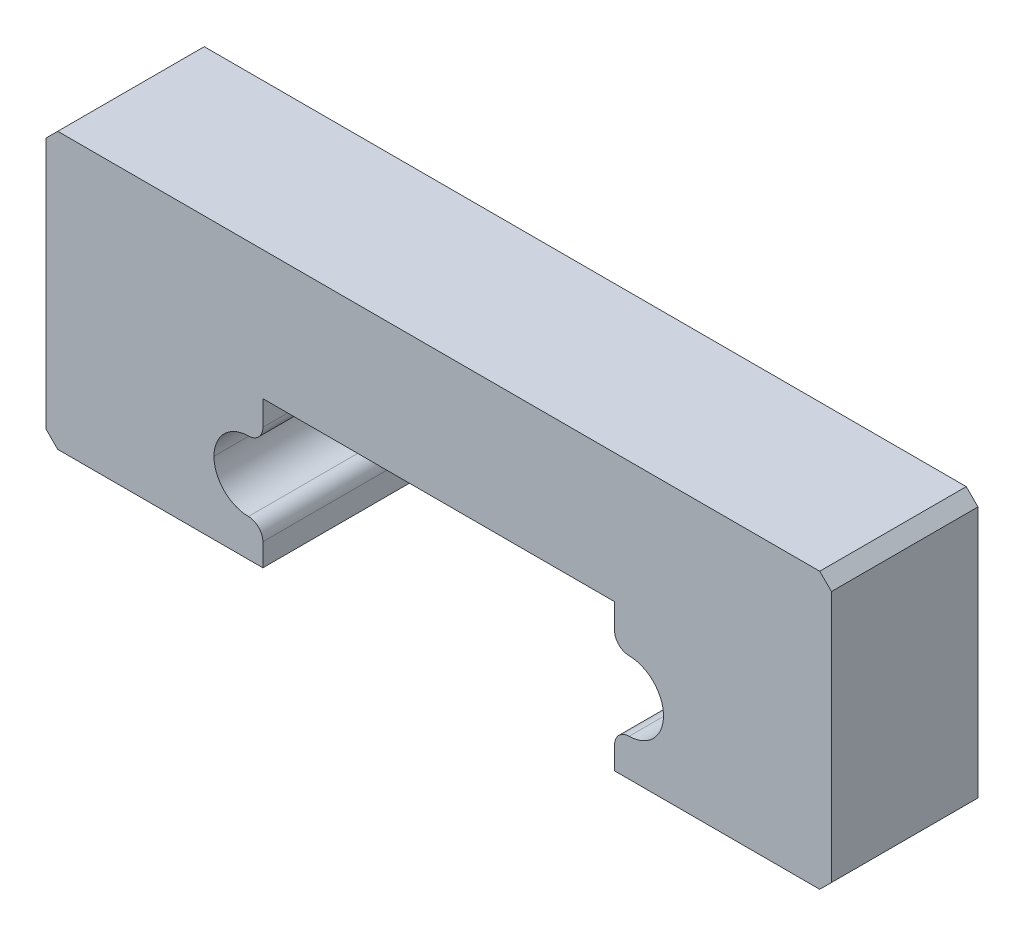
ISO-10303-21;
HEADER;
FILE_DESCRIPTION(('STEP AP214'),'2;1');
FILE_NAME('part.step','',(''),(''),'','','');
FILE_SCHEMA(('AUTOMOTIVE_DESIGN { 1 0 10303 214 1 1 1 1 }'));
ENDSEC;
DATA;
#1=APPLICATION_CONTEXT('core data for automotive mechanical design processes');
#2=APPLICATION_PROTOCOL_DEFINITION('international standard','automotive_design',2000,#1);
#3=PRODUCT_CONTEXT('',#1,'mechanical');
#4=PRODUCT('Part','Part','',(#3));
#5=PRODUCT_RELATED_PRODUCT_CATEGORY('part','',(#4));
#6=PRODUCT_DEFINITION_FORMATION('','',#4);
#7=PRODUCT_DEFINITION_CONTEXT('part definition',#1,'design');
#8=PRODUCT_DEFINITION('design','',#6,#7);
#9=PRODUCT_DEFINITION_SHAPE('','',#8);
#10=(LENGTH_UNIT() NAMED_UNIT(*) SI_UNIT(.MILLI.,.METRE.));
#11=(NAMED_UNIT(*) PLANE_ANGLE_UNIT() SI_UNIT($,.RADIAN.));
#12=(NAMED_UNIT(*) SI_UNIT($,.STERADIAN.) SOLID_ANGLE_UNIT());
#13=UNCERTAINTY_MEASURE_WITH_UNIT(LENGTH_MEASURE(1.E-05),#10,'distance_accuracy_value','');
#14=(GEOMETRIC_REPRESENTATION_CONTEXT(3) GLOBAL_UNCERTAINTY_ASSIGNED_CONTEXT((#13)) GLOBAL_UNIT_ASSIGNED_CONTEXT((#10,
#11,#12)) REPRESENTATION_CONTEXT('',''));
#15=CARTESIAN_POINT('',(0.,0.,0.));
#16=DIRECTION('',(0.,0.,1.));
#17=DIRECTION('',(1.,0.,0.));
#18=AXIS2_PLACEMENT_3D('',#15,#16,#17);
#19=CARTESIAN_POINT('',(-6.5,-4.22988165266092,5.));
#20=DIRECTION('',(0.,0.,-1.));
#21=DIRECTION('',(-1.,0.,0.));
#22=AXIS2_PLACEMENT_3D('',#19,#20,#21);
#23=CYLINDRICAL_SURFACE('',#22,0.5);
#24=CARTESIAN_POINT('',(-6.5,-4.22988165266092,5.));
#25=DIRECTION('',(0.,0.,1.));
#26=DIRECTION('',(1.,0.,0.));
#27=AXIS2_PLACEMENT_3D('',#24,#25,#26);
#28=CIRCLE('',#27,0.5);
#29=CARTESIAN_POINT('',(-6.,-4.22988165266092,5.));
#30=VERTEX_POINT('',#29);
#31=CARTESIAN_POINT('',(-6.49408284023669,-3.72991666666656,5.));
#32=VERTEX_POINT('',#31);
#33=EDGE_CURVE('E246',#30,#32,#28,.T.);
#34=ORIENTED_EDGE('',*,*,#33,.F.);
#35=DIRECTION('',(0.,0.,1.));
#36=VECTOR('',#35,1.);
#37=CARTESIAN_POINT('',(-6.,-4.22988165266092,5.));
#38=LINE('',#37,#36);
#39=CARTESIAN_POINT('',(-6.,-4.22988165266092,0.));
#40=VERTEX_POINT('',#39);
#41=EDGE_CURVE('E273',#40,#30,#38,.T.);
#42=ORIENTED_EDGE('',*,*,#41,.F.);
#43=CARTESIAN_POINT('',(-6.5,-4.22988165266092,0.));
#44=DIRECTION('',(0.,0.,-1.));
#45=DIRECTION('',(1.,0.,0.));
#46=AXIS2_PLACEMENT_3D('',#43,#44,#45);
#47=CIRCLE('',#46,0.5);
#48=CARTESIAN_POINT('',(-6.49408284023669,-3.72991666666656,0.));
#49=VERTEX_POINT('',#48);
#50=EDGE_CURVE('E11',#49,#40,#47,.T.);
#51=ORIENTED_EDGE('',*,*,#50,.F.);
#52=DIRECTION('',(0.,0.,-1.));
#53=VECTOR('',#52,1.);
#54=CARTESIAN_POINT('',(-6.49408284023669,-3.72991666666656,5.));
#55=LINE('',#54,#53);
#56=EDGE_CURVE('E322',#32,#49,#55,.T.);
#57=ORIENTED_EDGE('',*,*,#56,.F.);
#58=EDGE_LOOP('',(#34,#42,#51,#57));
#59=FACE_BOUND('',#58,.T.);
#60=ADVANCED_FACE('F16',(#59),#23,.T.);
#61=CARTESIAN_POINT('',(-6.5,-0.850118347339081,5.));
#62=DIRECTION('',(0.,0.,-1.));
#63=DIRECTION('',(-1.,0.,0.));
#64=AXIS2_PLACEMENT_3D('',#61,#62,#63);
#65=CYLINDRICAL_SURFACE('',#64,0.5);
#66=CARTESIAN_POINT('',(-6.5,-0.850118347339081,5.));
#67=DIRECTION('',(0.,0.,1.));
#68=DIRECTION('',(1.,0.,0.));
#69=AXIS2_PLACEMENT_3D('',#66,#67,#68);
#70=CIRCLE('',#69,0.5);
#71=CARTESIAN_POINT('',(-6.49408284023669,-1.35008333333344,5.));
#72=VERTEX_POINT('',#71);
#73=CARTESIAN_POINT('',(-6.,-0.850118347339081,5.));
#74=VERTEX_POINT('',#73);
#75=EDGE_CURVE('E205',#72,#74,#70,.T.);
#76=ORIENTED_EDGE('',*,*,#75,.F.);
#77=DIRECTION('',(0.,0.,1.));
#78=VECTOR('',#77,1.);
#79=CARTESIAN_POINT('',(-6.49408284023669,-1.35008333333344,5.));
#80=LINE('',#79,#78);
#81=CARTESIAN_POINT('',(-6.49408284023669,-1.35008333333344,0.));
#82=VERTEX_POINT('',#81);
#83=EDGE_CURVE('E203',#82,#72,#80,.T.);
#84=ORIENTED_EDGE('',*,*,#83,.F.);
#85=CARTESIAN_POINT('',(-6.5,-0.850118347339081,0.));
#86=DIRECTION('',(0.,0.,-1.));
#87=DIRECTION('',(1.,0.,0.));
#88=AXIS2_PLACEMENT_3D('',#85,#86,#87);
#89=CIRCLE('',#88,0.5);
#90=CARTESIAN_POINT('',(-6.,-0.850118347339081,0.));
#91=VERTEX_POINT('',#90);
#92=EDGE_CURVE('E27',#91,#82,#89,.T.);
#93=ORIENTED_EDGE('',*,*,#92,.F.);
#94=DIRECTION('',(0.,0.,-1.));
#95=VECTOR('',#94,1.);
#96=CARTESIAN_POINT('',(-6.,-0.850118347339081,5.));
#97=LINE('',#96,#95);
#98=EDGE_CURVE('E236',#74,#91,#97,.T.);
#99=ORIENTED_EDGE('',*,*,#98,.F.);
#100=EDGE_LOOP('',(#76,#84,#93,#99));
#101=FACE_BOUND('',#100,.T.);
#102=ADVANCED_FACE('F204',(#101),#65,.T.);
#103=CARTESIAN_POINT('',(6.5,-0.850118347339077,5.));
#104=DIRECTION('',(0.,0.,-1.));
#105=DIRECTION('',(-1.,0.,0.));
#106=AXIS2_PLACEMENT_3D('',#103,#104,#105);
#107=CYLINDRICAL_SURFACE('',#106,0.5);
#108=CARTESIAN_POINT('',(6.5,-0.850118347339077,5.));
#109=DIRECTION('',(0.,0.,1.));
#110=DIRECTION('',(1.,0.,0.));
#111=AXIS2_PLACEMENT_3D('',#108,#109,#110);
#112=CIRCLE('',#111,0.5);
#113=CARTESIAN_POINT('',(6.,-0.850118347339077,5.));
#114=VERTEX_POINT('',#113);
#115=CARTESIAN_POINT('',(6.49408284023669,-1.35008333333343,5.));
#116=VERTEX_POINT('',#115);
#117=EDGE_CURVE('E280',#114,#116,#112,.T.);
#118=ORIENTED_EDGE('',*,*,#117,.F.);
#119=DIRECTION('',(0.,0.,1.));
#120=VECTOR('',#119,1.);
#121=CARTESIAN_POINT('',(6.,-0.850118347339077,5.));
#122=LINE('',#121,#120);
#123=CARTESIAN_POINT('',(6.,-0.850118347339077,0.));
#124=VERTEX_POINT('',#123);
#125=EDGE_CURVE('E265',#124,#114,#122,.T.);
#126=ORIENTED_EDGE('',*,*,#125,.F.);
#127=CARTESIAN_POINT('',(6.5,-0.850118347339077,0.));
#128=DIRECTION('',(0.,0.,-1.));
#129=DIRECTION('',(1.,0.,0.));
#130=AXIS2_PLACEMENT_3D('',#127,#128,#129);
#131=CIRCLE('',#130,0.5);
#132=CARTESIAN_POINT('',(6.49408284023669,-1.35008333333343,0.));
#133=VERTEX_POINT('',#132);
#134=EDGE_CURVE('E200',#133,#124,#131,.T.);
#135=ORIENTED_EDGE('',*,*,#134,.F.);
#136=DIRECTION('',(0.,0.,-1.));
#137=VECTOR('',#136,1.);
#138=CARTESIAN_POINT('',(6.49408284023669,-1.35008333333343,5.));
#139=LINE('',#138,#137);
#140=EDGE_CURVE('E231',#116,#133,#139,.T.);
#141=ORIENTED_EDGE('',*,*,#140,.F.);
#142=EDGE_LOOP('',(#118,#126,#135,#141));
#143=FACE_BOUND('',#142,.T.);
#144=ADVANCED_FACE('F414',(#143),#107,.T.);
#145=CARTESIAN_POINT('',(6.5,-4.22988165266092,5.));
#146=DIRECTION('',(0.,0.,-1.));
#147=DIRECTION('',(-1.,0.,0.));
#148=AXIS2_PLACEMENT_3D('',#145,#146,#147);
#149=CYLINDRICAL_SURFACE('',#148,0.5);
#150=CARTESIAN_POINT('',(6.5,-4.22988165266092,5.));
#151=DIRECTION('',(0.,0.,1.));
#152=DIRECTION('',(1.,0.,0.));
#153=AXIS2_PLACEMENT_3D('',#150,#151,#152);
#154=CIRCLE('',#153,0.5);
#155=CARTESIAN_POINT('',(6.49408284023669,-3.72991666666656,5.));
#156=VERTEX_POINT('',#155);
#157=CARTESIAN_POINT('',(6.,-4.22988165266092,5.));
#158=VERTEX_POINT('',#157);
#159=EDGE_CURVE('E249',#156,#158,#154,.T.);
#160=ORIENTED_EDGE('',*,*,#159,.F.);
#161=DIRECTION('',(0.,0.,1.));
#162=VECTOR('',#161,1.);
#163=CARTESIAN_POINT('',(6.49408284023669,-3.72991666666656,5.));
#164=LINE('',#163,#162);
#165=CARTESIAN_POINT('',(6.49408284023669,-3.72991666666656,0.));
#166=VERTEX_POINT('',#165);
#167=EDGE_CURVE('E269',#166,#156,#164,.T.);
#168=ORIENTED_EDGE('',*,*,#167,.F.);
#169=CARTESIAN_POINT('',(6.5,-4.22988165266092,0.));
#170=DIRECTION('',(0.,0.,-1.));
#171=DIRECTION('',(1.,0.,0.));
#172=AXIS2_PLACEMENT_3D('',#169,#170,#171);
#173=CIRCLE('',#172,0.5);
#174=CARTESIAN_POINT('',(6.,-4.22988165266092,0.));
#175=VERTEX_POINT('',#174);
#176=EDGE_CURVE('E283',#175,#166,#173,.T.);
#177=ORIENTED_EDGE('',*,*,#176,.F.);
#178=DIRECTION('',(0.,0.,-1.));
#179=VECTOR('',#178,1.);
#180=CARTESIAN_POINT('',(6.,-4.22988165266092,5.));
#181=LINE('',#180,#179);
#182=EDGE_CURVE('E230',#158,#175,#181,.T.);
#183=ORIENTED_EDGE('',*,*,#182,.F.);
#184=EDGE_LOOP('',(#160,#168,#177,#183));
#185=FACE_BOUND('',#184,.T.);
#186=ADVANCED_FACE('F408',(#185),#149,.T.);
#187=CARTESIAN_POINT('',(-6.48,-2.54,0.));
#188=DIRECTION('',(0.,0.,1.));
#189=DIRECTION('',(1.,0.,0.));
#190=AXIS2_PLACEMENT_3D('',#187,#188,#189);
#191=PLANE('',#190);
#192=DIRECTION('',(0.,-1.,0.));
#193=VECTOR('',#192,1.);
#194=CARTESIAN_POINT('',(6.,-5.,0.));
#195=LINE('',#194,#193);
#196=CARTESIAN_POINT('',(6.,-5.,0.));
#197=VERTEX_POINT('',#196);
#198=EDGE_CURVE('E241',#175,#197,#195,.T.);
#199=ORIENTED_EDGE('',*,*,#198,.F.);
#200=ORIENTED_EDGE('',*,*,#176,.T.);
#201=CARTESIAN_POINT('',(6.48,-2.54,0.));
#202=DIRECTION('',(0.,0.,-1.));
#203=DIRECTION('',(-1.,0.,0.));
#204=AXIS2_PLACEMENT_3D('',#201,#202,#203);
#205=CIRCLE('',#204,1.19);
#206=EDGE_CURVE('E264',#133,#166,#205,.T.);
#207=ORIENTED_EDGE('',*,*,#206,.F.);
#208=ORIENTED_EDGE('',*,*,#134,.T.);
#209=DIRECTION('',(0.,-1.,0.));
#210=VECTOR('',#209,1.);
#211=CARTESIAN_POINT('',(6.,0.,0.));
#212=LINE('',#211,#210);
#213=CARTESIAN_POINT('',(6.,0.,0.));
#214=VERTEX_POINT('',#213);
#215=EDGE_CURVE('E379',#214,#124,#212,.T.);
#216=ORIENTED_EDGE('',*,*,#215,.F.);
#217=DIRECTION('',(1.,0.,0.));
#218=VECTOR('',#217,1.);
#219=CARTESIAN_POINT('',(6.,0.,0.));
#220=LINE('',#219,#218);
#221=CARTESIAN_POINT('',(-6.,0.,0.));
#222=VERTEX_POINT('',#221);
#223=EDGE_CURVE('E316',#222,#214,#220,.T.);
#224=ORIENTED_EDGE('',*,*,#223,.F.);
#225=DIRECTION('',(0.,1.,0.));
#226=VECTOR('',#225,1.);
#227=CARTESIAN_POINT('',(-6.,0.,0.));
#228=LINE('',#227,#226);
#229=EDGE_CURVE('E195',#91,#222,#228,.T.);
#230=ORIENTED_EDGE('',*,*,#229,.F.);
#231=ORIENTED_EDGE('',*,*,#92,.T.);
#232=CARTESIAN_POINT('',(-6.48,-2.54,0.));
#233=DIRECTION('',(0.,0.,-1.));
#234=DIRECTION('',(1.,0.,0.));
#235=AXIS2_PLACEMENT_3D('',#232,#233,#234);
#236=CIRCLE('',#235,1.19);
#237=CARTESIAN_POINT('',(-7.67,-2.54,0.));
#238=VERTEX_POINT('',#237);
#239=EDGE_CURVE('E192',#238,#82,#236,.T.);
#240=ORIENTED_EDGE('',*,*,#239,.F.);
#241=CARTESIAN_POINT('',(-6.48,-2.54,0.));
#242=DIRECTION('',(0.,0.,-1.));
#243=DIRECTION('',(1.,0.,0.));
#244=AXIS2_PLACEMENT_3D('',#241,#242,#243);
#245=CIRCLE('',#244,1.19);
#246=EDGE_CURVE('E237',#49,#238,#245,.T.);
#247=ORIENTED_EDGE('',*,*,#246,.F.);
#248=ORIENTED_EDGE('',*,*,#50,.T.);
#249=DIRECTION('',(0.,1.,0.));
#250=VECTOR('',#249,1.);
#251=CARTESIAN_POINT('',(-6.,-5.,0.));
#252=LINE('',#251,#250);
#253=CARTESIAN_POINT('',(-6.,-5.,0.));
#254=VERTEX_POINT('',#253);
#255=EDGE_CURVE('E210',#254,#40,#252,.T.);
#256=ORIENTED_EDGE('',*,*,#255,.F.);
#257=DIRECTION('',(1.,0.,0.));
#258=VECTOR('',#257,1.);
#259=CARTESIAN_POINT('',(-6.,-5.,0.));
#260=LINE('',#259,#258);
#261=CARTESIAN_POINT('',(-13.,-5.,0.));
#262=VERTEX_POINT('',#261);
#263=EDGE_CURVE('E425',#262,#254,#260,.T.);
#264=ORIENTED_EDGE('',*,*,#263,.F.);
#265=DIRECTION('',(0.707106781186548,-0.707106781186548,0.));
#266=VECTOR('',#265,1.);
#267=CARTESIAN_POINT('',(-13.,-5.,0.));
#268=LINE('',#267,#266);
#269=CARTESIAN_POINT('',(-13.4,-4.6,0.));
#270=VERTEX_POINT('',#269);
#271=EDGE_CURVE('E254',#270,#262,#268,.T.);
#272=ORIENTED_EDGE('',*,*,#271,.F.);
#273=DIRECTION('',(0.,-1.,0.));
#274=VECTOR('',#273,1.);
#275=CARTESIAN_POINT('',(-13.4,-4.6,0.));
#276=LINE('',#275,#274);
#277=CARTESIAN_POINT('',(-13.4,4.,0.));
#278=VERTEX_POINT('',#277);
#279=EDGE_CURVE('E354',#278,#270,#276,.T.);
#280=ORIENTED_EDGE('',*,*,#279,.F.);
#281=DIRECTION('',(-0.707106781186547,-0.707106781186548,0.));
#282=VECTOR('',#281,1.);
#283=CARTESIAN_POINT('',(-13.4,4.,0.));
#284=LINE('',#283,#282);
#285=CARTESIAN_POINT('',(-13.,4.4,0.));
#286=VERTEX_POINT('',#285);
#287=EDGE_CURVE('E330',#286,#278,#284,.T.);
#288=ORIENTED_EDGE('',*,*,#287,.F.);
#289=DIRECTION('',(-1.,0.,0.));
#290=VECTOR('',#289,1.);
#291=CARTESIAN_POINT('',(-13.,4.4,0.));
#292=LINE('',#291,#290);
#293=CARTESIAN_POINT('',(13.,4.4,0.));
#294=VERTEX_POINT('',#293);
#295=EDGE_CURVE('E295',#294,#286,#292,.T.);
#296=ORIENTED_EDGE('',*,*,#295,.F.);
#297=DIRECTION('',(-0.707106781186548,0.707106781186548,0.));
#298=VECTOR('',#297,1.);
#299=CARTESIAN_POINT('',(13.4,4.,0.));
#300=LINE('',#299,#298);
#301=CARTESIAN_POINT('',(13.4,4.,0.));
#302=VERTEX_POINT('',#301);
#303=EDGE_CURVE('E289',#302,#294,#300,.T.);
#304=ORIENTED_EDGE('',*,*,#303,.F.);
#305=DIRECTION('',(0.,1.,0.));
#306=VECTOR('',#305,1.);
#307=CARTESIAN_POINT('',(13.4,-4.6,0.));
#308=LINE('',#307,#306);
#309=CARTESIAN_POINT('',(13.4,-4.6,0.));
#310=VERTEX_POINT('',#309);
#311=EDGE_CURVE('E307',#310,#302,#308,.T.);
#312=ORIENTED_EDGE('',*,*,#311,.F.);
#313=DIRECTION('',(0.707106781186548,0.707106781186548,0.));
#314=VECTOR('',#313,1.);
#315=CARTESIAN_POINT('',(13.,-5.,0.));
#316=LINE('',#315,#314);
#317=CARTESIAN_POINT('',(13.,-5.,0.));
#318=VERTEX_POINT('',#317);
#319=EDGE_CURVE('E279',#318,#310,#316,.T.);
#320=ORIENTED_EDGE('',*,*,#319,.F.);
#321=DIRECTION('',(1.,0.,0.));
#322=VECTOR('',#321,1.);
#323=CARTESIAN_POINT('',(6.,-5.,0.));
#324=LINE('',#323,#322);
#325=EDGE_CURVE('E301',#197,#318,#324,.T.);
#326=ORIENTED_EDGE('',*,*,#325,.F.);
#327=EDGE_LOOP('',(#199,#200,#207,#208,#216,#224,#230,#231,#240,#247,#248,#256,#264,#272,#280,
#288,#296,#304,#312,#320,#326));
#328=FACE_BOUND('',#327,.T.);
#329=ADVANCED_FACE('F189',(#328),#191,.F.);
#330=CARTESIAN_POINT('',(-6.48,-2.54,5.));
#331=DIRECTION('',(0.,0.,1.));
#332=DIRECTION('',(1.,0.,0.));
#333=AXIS2_PLACEMENT_3D('',#330,#331,#332);
#334=PLANE('',#333);
#335=CARTESIAN_POINT('',(6.48,-2.54,5.));
#336=DIRECTION('',(0.,0.,-1.));
#337=DIRECTION('',(-1.,0.,0.));
#338=AXIS2_PLACEMENT_3D('',#335,#336,#337);
#339=CIRCLE('',#338,1.19);
#340=EDGE_CURVE('E245',#116,#156,#339,.T.);
#341=ORIENTED_EDGE('',*,*,#340,.T.);
#342=ORIENTED_EDGE('',*,*,#159,.T.);
#343=DIRECTION('',(0.,-1.,0.));
#344=VECTOR('',#343,1.);
#345=CARTESIAN_POINT('',(6.,-5.,5.));
#346=LINE('',#345,#344);
#347=CARTESIAN_POINT('',(6.,-5.,5.));
#348=VERTEX_POINT('',#347);
#349=EDGE_CURVE('E226',#158,#348,#346,.T.);
#350=ORIENTED_EDGE('',*,*,#349,.T.);
#351=DIRECTION('',(1.,0.,0.));
#352=VECTOR('',#351,1.);
#353=CARTESIAN_POINT('',(6.,-5.,5.));
#354=LINE('',#353,#352);
#355=CARTESIAN_POINT('',(13.,-5.,5.));
#356=VERTEX_POINT('',#355);
#357=EDGE_CURVE('E300',#348,#356,#354,.T.);
#358=ORIENTED_EDGE('',*,*,#357,.T.);
#359=DIRECTION('',(0.707106781186548,0.707106781186548,0.));
#360=VECTOR('',#359,1.);
#361=CARTESIAN_POINT('',(13.,-5.,5.));
#362=LINE('',#361,#360);
#363=CARTESIAN_POINT('',(13.4,-4.6,5.));
#364=VERTEX_POINT('',#363);
#365=EDGE_CURVE('E278',#356,#364,#362,.T.);
#366=ORIENTED_EDGE('',*,*,#365,.T.);
#367=DIRECTION('',(0.,1.,0.));
#368=VECTOR('',#367,1.);
#369=CARTESIAN_POINT('',(13.4,-4.6,5.));
#370=LINE('',#369,#368);
#371=CARTESIAN_POINT('',(13.4,4.,5.));
#372=VERTEX_POINT('',#371);
#373=EDGE_CURVE('E306',#364,#372,#370,.T.);
#374=ORIENTED_EDGE('',*,*,#373,.T.);
#375=DIRECTION('',(-0.707106781186548,0.707106781186548,0.));
#376=VECTOR('',#375,1.);
#377=CARTESIAN_POINT('',(13.4,4.,5.));
#378=LINE('',#377,#376);
#379=CARTESIAN_POINT('',(13.,4.4,5.));
#380=VERTEX_POINT('',#379);
#381=EDGE_CURVE('E288',#372,#380,#378,.T.);
#382=ORIENTED_EDGE('',*,*,#381,.T.);
#383=DIRECTION('',(-1.,0.,0.));
#384=VECTOR('',#383,1.);
#385=CARTESIAN_POINT('',(-13.,4.4,5.));
#386=LINE('',#385,#384);
#387=CARTESIAN_POINT('',(-13.,4.4,5.));
#388=VERTEX_POINT('',#387);
#389=EDGE_CURVE('E294',#380,#388,#386,.T.);
#390=ORIENTED_EDGE('',*,*,#389,.T.);
#391=DIRECTION('',(-0.707106781186547,-0.707106781186548,0.));
#392=VECTOR('',#391,1.);
#393=CARTESIAN_POINT('',(-13.4,4.,5.));
#394=LINE('',#393,#392);
#395=CARTESIAN_POINT('',(-13.4,4.,5.));
#396=VERTEX_POINT('',#395);
#397=EDGE_CURVE('E350',#388,#396,#394,.T.);
#398=ORIENTED_EDGE('',*,*,#397,.T.);
#399=DIRECTION('',(0.,-1.,0.));
#400=VECTOR('',#399,1.);
#401=CARTESIAN_POINT('',(-13.4,-4.6,5.));
#402=LINE('',#401,#400);
#403=CARTESIAN_POINT('',(-13.4,-4.6,5.));
#404=VERTEX_POINT('',#403);
#405=EDGE_CURVE('E259',#396,#404,#402,.T.);
#406=ORIENTED_EDGE('',*,*,#405,.T.);
#407=DIRECTION('',(0.707106781186548,-0.707106781186548,0.));
#408=VECTOR('',#407,1.);
#409=CARTESIAN_POINT('',(-13.,-5.,5.));
#410=LINE('',#409,#408);
#411=CARTESIAN_POINT('',(-13.,-5.,5.));
#412=VERTEX_POINT('',#411);
#413=EDGE_CURVE('E422',#404,#412,#410,.T.);
#414=ORIENTED_EDGE('',*,*,#413,.T.);
#415=DIRECTION('',(1.,0.,0.));
#416=VECTOR('',#415,1.);
#417=CARTESIAN_POINT('',(-6.,-5.,5.));
#418=LINE('',#417,#416);
#419=CARTESIAN_POINT('',(-6.,-5.,5.));
#420=VERTEX_POINT('',#419);
#421=EDGE_CURVE('E42',#412,#420,#418,.T.);
#422=ORIENTED_EDGE('',*,*,#421,.T.);
#423=DIRECTION('',(0.,1.,0.));
#424=VECTOR('',#423,1.);
#425=CARTESIAN_POINT('',(-6.,-5.,5.));
#426=LINE('',#425,#424);
#427=EDGE_CURVE('E349',#420,#30,#426,.T.);
#428=ORIENTED_EDGE('',*,*,#427,.T.);
#429=ORIENTED_EDGE('',*,*,#33,.T.);
#430=CARTESIAN_POINT('',(-6.48,-2.54,5.));
#431=DIRECTION('',(0.,0.,-1.));
#432=DIRECTION('',(1.,0.,0.));
#433=AXIS2_PLACEMENT_3D('',#430,#431,#432);
#434=CIRCLE('',#433,1.19);
#435=CARTESIAN_POINT('',(-7.67,-2.54,5.));
#436=VERTEX_POINT('',#435);
#437=EDGE_CURVE('E326',#32,#436,#434,.T.);
#438=ORIENTED_EDGE('',*,*,#437,.T.);
#439=CARTESIAN_POINT('',(-6.48,-2.54,5.));
#440=DIRECTION('',(0.,0.,-1.));
#441=DIRECTION('',(1.,0.,0.));
#442=AXIS2_PLACEMENT_3D('',#439,#440,#441);
#443=CIRCLE('',#442,1.19);
#444=EDGE_CURVE('E221',#436,#72,#443,.T.);
#445=ORIENTED_EDGE('',*,*,#444,.T.);
#446=ORIENTED_EDGE('',*,*,#75,.T.);
#447=DIRECTION('',(0.,1.,0.));
#448=VECTOR('',#447,1.);
#449=CARTESIAN_POINT('',(-6.,0.,5.));
#450=LINE('',#449,#448);
#451=CARTESIAN_POINT('',(-6.,0.,5.));
#452=VERTEX_POINT('',#451);
#453=EDGE_CURVE('E232',#74,#452,#450,.T.);
#454=ORIENTED_EDGE('',*,*,#453,.T.);
#455=DIRECTION('',(1.,0.,0.));
#456=VECTOR('',#455,1.);
#457=CARTESIAN_POINT('',(6.,0.,5.));
#458=LINE('',#457,#456);
#459=CARTESIAN_POINT('',(6.,0.,5.));
#460=VERTEX_POINT('',#459);
#461=EDGE_CURVE('E315',#452,#460,#458,.T.);
#462=ORIENTED_EDGE('',*,*,#461,.T.);
#463=DIRECTION('',(0.,-1.,0.));
#464=VECTOR('',#463,1.);
#465=CARTESIAN_POINT('',(6.,0.,5.));
#466=LINE('',#465,#464);
#467=EDGE_CURVE('E260',#460,#114,#466,.T.);
#468=ORIENTED_EDGE('',*,*,#467,.T.);
#469=ORIENTED_EDGE('',*,*,#117,.T.);
#470=EDGE_LOOP('',(#341,#342,#350,#358,#366,#374,#382,#390,#398,#406,#414,#422,#428,#429,#438,
#445,#446,#454,#462,#468,#469));
#471=FACE_BOUND('',#470,.T.);
#472=ADVANCED_FACE('F18',(#471),#334,.T.);
#473=CARTESIAN_POINT('',(-6.,-5.,5.));
#474=DIRECTION('',(0.,1.,0.));
#475=DIRECTION('',(1.,0.,0.));
#476=AXIS2_PLACEMENT_3D('',#473,#474,#475);
#477=PLANE('',#476);
#478=ORIENTED_EDGE('',*,*,#263,.T.);
#479=DIRECTION('',(0.,0.,-1.));
#480=VECTOR('',#479,1.);
#481=CARTESIAN_POINT('',(-6.,-5.,5.));
#482=LINE('',#481,#480);
#483=EDGE_CURVE('E345',#420,#254,#482,.T.);
#484=ORIENTED_EDGE('',*,*,#483,.F.);
#485=ORIENTED_EDGE('',*,*,#421,.F.);
#486=DIRECTION('',(0.,0.,-1.));
#487=VECTOR('',#486,1.);
#488=CARTESIAN_POINT('',(-13.,-5.,5.));
#489=LINE('',#488,#487);
#490=EDGE_CURVE('E258',#412,#262,#489,.T.);
#491=ORIENTED_EDGE('',*,*,#490,.T.);
#492=EDGE_LOOP('',(#478,#484,#485,#491));
#493=FACE_BOUND('',#492,.T.);
#494=ADVANCED_FACE('F459',(#493),#477,.F.);
#495=CARTESIAN_POINT('',(-13.,-5.,5.));
#496=DIRECTION('',(0.707106781186548,0.707106781186548,0.));
#497=DIRECTION('',(0.,0.,-1.));
#498=AXIS2_PLACEMENT_3D('',#495,#496,#497);
#499=PLANE('',#498);
#500=ORIENTED_EDGE('',*,*,#271,.T.);
#501=ORIENTED_EDGE('',*,*,#490,.F.);
#502=ORIENTED_EDGE('',*,*,#413,.F.);
#503=DIRECTION('',(0.,0.,-1.));
#504=VECTOR('',#503,1.);
#505=CARTESIAN_POINT('',(-13.4,-4.6,5.));
#506=LINE('',#505,#504);
#507=EDGE_CURVE('E371',#404,#270,#506,.T.);
#508=ORIENTED_EDGE('',*,*,#507,.T.);
#509=EDGE_LOOP('',(#500,#501,#502,#508));
#510=FACE_BOUND('',#509,.T.);
#511=ADVANCED_FACE('F452',(#510),#499,.F.);
#512=CARTESIAN_POINT('',(-13.4,-4.6,5.));
#513=DIRECTION('',(1.,0.,0.));
#514=DIRECTION('',(0.,1.,0.));
#515=AXIS2_PLACEMENT_3D('',#512,#513,#514);
#516=PLANE('',#515);
#517=ORIENTED_EDGE('',*,*,#279,.T.);
#518=ORIENTED_EDGE('',*,*,#507,.F.);
#519=ORIENTED_EDGE('',*,*,#405,.F.);
#520=DIRECTION('',(0.,0.,-1.));
#521=VECTOR('',#520,1.);
#522=CARTESIAN_POINT('',(-13.4,4.,5.));
#523=LINE('',#522,#521);
#524=EDGE_CURVE('E20',#396,#278,#523,.T.);
#525=ORIENTED_EDGE('',*,*,#524,.T.);
#526=EDGE_LOOP('',(#517,#518,#519,#525));
#527=FACE_BOUND('',#526,.T.);
#528=ADVANCED_FACE('F456',(#527),#516,.F.);
#529=CARTESIAN_POINT('',(-13.4,4.,5.));
#530=DIRECTION('',(0.707106781186548,-0.707106781186547,0.));
#531=DIRECTION('',(0.,0.,-1.));
#532=AXIS2_PLACEMENT_3D('',#529,#530,#531);
#533=PLANE('',#532);
#534=ORIENTED_EDGE('',*,*,#287,.T.);
#535=ORIENTED_EDGE('',*,*,#524,.F.);
#536=ORIENTED_EDGE('',*,*,#397,.F.);
#537=DIRECTION('',(0.,0.,-1.));
#538=VECTOR('',#537,1.);
#539=CARTESIAN_POINT('',(-13.,4.4,5.));
#540=LINE('',#539,#538);
#541=EDGE_CURVE('E290',#388,#286,#540,.T.);
#542=ORIENTED_EDGE('',*,*,#541,.T.);
#543=EDGE_LOOP('',(#534,#535,#536,#542));
#544=FACE_BOUND('',#543,.T.);
#545=ADVANCED_FACE('F499',(#544),#533,.F.);
#546=CARTESIAN_POINT('',(-13.,4.4,5.));
#547=DIRECTION('',(0.,-1.,0.));
#548=DIRECTION('',(0.,0.,-1.));
#549=AXIS2_PLACEMENT_3D('',#546,#547,#548);
#550=PLANE('',#549);
#551=ORIENTED_EDGE('',*,*,#295,.T.);
#552=ORIENTED_EDGE('',*,*,#541,.F.);
#553=ORIENTED_EDGE('',*,*,#389,.F.);
#554=DIRECTION('',(0.,0.,-1.));
#555=VECTOR('',#554,1.);
#556=CARTESIAN_POINT('',(13.,4.4,5.));
#557=LINE('',#556,#555);
#558=EDGE_CURVE('E284',#380,#294,#557,.T.);
#559=ORIENTED_EDGE('',*,*,#558,.T.);
#560=EDGE_LOOP('',(#551,#552,#553,#559));
#561=FACE_BOUND('',#560,.T.);
#562=ADVANCED_FACE('F489',(#561),#550,.F.);
#563=CARTESIAN_POINT('',(13.4,4.,5.));
#564=DIRECTION('',(-0.707106781186548,-0.707106781186548,0.));
#565=DIRECTION('',(-0.707106781186548,0.707106781186548,0.));
#566=AXIS2_PLACEMENT_3D('',#563,#564,#565);
#567=PLANE('',#566);
#568=ORIENTED_EDGE('',*,*,#303,.T.);
#569=ORIENTED_EDGE('',*,*,#558,.F.);
#570=ORIENTED_EDGE('',*,*,#381,.F.);
#571=DIRECTION('',(0.,0.,-1.));
#572=VECTOR('',#571,1.);
#573=CARTESIAN_POINT('',(13.4,4.,5.));
#574=LINE('',#573,#572);
#575=EDGE_CURVE('E302',#372,#302,#574,.T.);
#576=ORIENTED_EDGE('',*,*,#575,.T.);
#577=EDGE_LOOP('',(#568,#569,#570,#576));
#578=FACE_BOUND('',#577,.T.);
#579=ADVANCED_FACE('F486',(#578),#567,.F.);
#580=CARTESIAN_POINT('',(13.4,-4.6,5.));
#581=DIRECTION('',(-1.,0.,0.));
#582=DIRECTION('',(0.,1.,0.));
#583=AXIS2_PLACEMENT_3D('',#580,#581,#582);
#584=PLANE('',#583);
#585=ORIENTED_EDGE('',*,*,#311,.T.);
#586=ORIENTED_EDGE('',*,*,#575,.F.);
#587=ORIENTED_EDGE('',*,*,#373,.F.);
#588=DIRECTION('',(0.,0.,-1.));
#589=VECTOR('',#588,1.);
#590=CARTESIAN_POINT('',(13.4,-4.6,5.));
#591=LINE('',#590,#589);
#592=EDGE_CURVE('E274',#364,#310,#591,.T.);
#593=ORIENTED_EDGE('',*,*,#592,.T.);
#594=EDGE_LOOP('',(#585,#586,#587,#593));
#595=FACE_BOUND('',#594,.T.);
#596=ADVANCED_FACE('F488',(#595),#584,.F.);
#597=CARTESIAN_POINT('',(13.,-5.,5.));
#598=DIRECTION('',(-0.707106781186548,0.707106781186548,0.));
#599=DIRECTION('',(0.,0.,1.));
#600=AXIS2_PLACEMENT_3D('',#597,#598,#599);
#601=PLANE('',#600);
#602=ORIENTED_EDGE('',*,*,#319,.T.);
#603=ORIENTED_EDGE('',*,*,#592,.F.);
#604=ORIENTED_EDGE('',*,*,#365,.F.);
#605=DIRECTION('',(0.,0.,-1.));
#606=VECTOR('',#605,1.);
#607=CARTESIAN_POINT('',(13.,-5.,5.));
#608=LINE('',#607,#606);
#609=EDGE_CURVE('E296',#356,#318,#608,.T.);
#610=ORIENTED_EDGE('',*,*,#609,.T.);
#611=EDGE_LOOP('',(#602,#603,#604,#610));
#612=FACE_BOUND('',#611,.T.);
#613=ADVANCED_FACE('F496',(#612),#601,.F.);
#614=CARTESIAN_POINT('',(6.,-5.,5.));
#615=DIRECTION('',(0.,1.,0.));
#616=DIRECTION('',(1.,0.,0.));
#617=AXIS2_PLACEMENT_3D('',#614,#615,#616);
#618=PLANE('',#617);
#619=ORIENTED_EDGE('',*,*,#325,.T.);
#620=ORIENTED_EDGE('',*,*,#609,.F.);
#621=ORIENTED_EDGE('',*,*,#357,.F.);
#622=DIRECTION('',(0.,0.,-1.));
#623=VECTOR('',#622,1.);
#624=CARTESIAN_POINT('',(6.,-5.,5.));
#625=LINE('',#624,#623);
#626=EDGE_CURVE('E252',#348,#197,#625,.T.);
#627=ORIENTED_EDGE('',*,*,#626,.T.);
#628=EDGE_LOOP('',(#619,#620,#621,#627));
#629=FACE_BOUND('',#628,.T.);
#630=ADVANCED_FACE('F536',(#629),#618,.F.);
#631=CARTESIAN_POINT('',(6.,-5.,5.));
#632=DIRECTION('',(1.,0.,0.));
#633=DIRECTION('',(0.,-1.,0.));
#634=AXIS2_PLACEMENT_3D('',#631,#632,#633);
#635=PLANE('',#634);
#636=ORIENTED_EDGE('',*,*,#349,.F.);
#637=ORIENTED_EDGE('',*,*,#182,.T.);
#638=ORIENTED_EDGE('',*,*,#198,.T.);
#639=ORIENTED_EDGE('',*,*,#626,.F.);
#640=EDGE_LOOP('',(#636,#637,#638,#639));
#641=FACE_BOUND('',#640,.T.);
#642=ADVANCED_FACE('F533',(#641),#635,.F.);
#643=CARTESIAN_POINT('',(6.48,-2.54,5.));
#644=DIRECTION('',(0.,0.,-1.));
#645=DIRECTION('',(-1.,0.,0.));
#646=AXIS2_PLACEMENT_3D('',#643,#644,#645);
#647=CYLINDRICAL_SURFACE('',#646,1.19);
#648=ORIENTED_EDGE('',*,*,#206,.T.);
#649=ORIENTED_EDGE('',*,*,#167,.T.);
#650=ORIENTED_EDGE('',*,*,#340,.F.);
#651=ORIENTED_EDGE('',*,*,#140,.T.);
#652=EDGE_LOOP('',(#648,#649,#650,#651));
#653=FACE_BOUND('',#652,.T.);
#654=ADVANCED_FACE('F398',(#653),#647,.F.);
#655=CARTESIAN_POINT('',(6.,0.,5.));
#656=DIRECTION('',(1.,0.,0.));
#657=DIRECTION('',(0.,1.,0.));
#658=AXIS2_PLACEMENT_3D('',#655,#656,#657);
#659=PLANE('',#658);
#660=ORIENTED_EDGE('',*,*,#215,.T.);
#661=ORIENTED_EDGE('',*,*,#125,.T.);
#662=ORIENTED_EDGE('',*,*,#467,.F.);
#663=DIRECTION('',(0.,0.,-1.));
#664=VECTOR('',#663,1.);
#665=CARTESIAN_POINT('',(6.,0.,5.));
#666=LINE('',#665,#664);
#667=EDGE_CURVE('E311',#460,#214,#666,.T.);
#668=ORIENTED_EDGE('',*,*,#667,.T.);
#669=EDGE_LOOP('',(#660,#661,#662,#668));
#670=FACE_BOUND('',#669,.T.);
#671=ADVANCED_FACE('F540',(#670),#659,.F.);
#672=CARTESIAN_POINT('',(6.,0.,5.));
#673=DIRECTION('',(0.,1.,0.));
#674=DIRECTION('',(1.,0.,0.));
#675=AXIS2_PLACEMENT_3D('',#672,#673,#674);
#676=PLANE('',#675);
#677=ORIENTED_EDGE('',*,*,#223,.T.);
#678=ORIENTED_EDGE('',*,*,#667,.F.);
#679=ORIENTED_EDGE('',*,*,#461,.F.);
#680=DIRECTION('',(0.,0.,-1.));
#681=VECTOR('',#680,1.);
#682=CARTESIAN_POINT('',(-6.,0.,5.));
#683=LINE('',#682,#681);
#684=EDGE_CURVE('E339',#452,#222,#683,.T.);
#685=ORIENTED_EDGE('',*,*,#684,.T.);
#686=EDGE_LOOP('',(#677,#678,#679,#685));
#687=FACE_BOUND('',#686,.T.);
#688=ADVANCED_FACE('F541',(#687),#676,.F.);
#689=CARTESIAN_POINT('',(-6.,0.,5.));
#690=DIRECTION('',(-1.,0.,0.));
#691=DIRECTION('',(0.,0.,1.));
#692=AXIS2_PLACEMENT_3D('',#689,#690,#691);
#693=PLANE('',#692);
#694=ORIENTED_EDGE('',*,*,#453,.F.);
#695=ORIENTED_EDGE('',*,*,#98,.T.);
#696=ORIENTED_EDGE('',*,*,#229,.T.);
#697=ORIENTED_EDGE('',*,*,#684,.F.);
#698=EDGE_LOOP('',(#694,#695,#696,#697));
#699=FACE_BOUND('',#698,.T.);
#700=ADVANCED_FACE('F484',(#699),#693,.F.);
#701=CARTESIAN_POINT('',(-6.48,-2.54,5.));
#702=DIRECTION('',(0.,0.,-1.));
#703=DIRECTION('',(-1.,0.,0.));
#704=AXIS2_PLACEMENT_3D('',#701,#702,#703);
#705=CYLINDRICAL_SURFACE('',#704,1.19);
#706=DIRECTION('',(0.,0.,-1.));
#707=VECTOR('',#706,1.);
#708=CARTESIAN_POINT('',(-7.67,-2.54,5.));
#709=LINE('',#708,#707);
#710=EDGE_CURVE('E214',#436,#238,#709,.T.);
#711=ORIENTED_EDGE('',*,*,#710,.F.);
#712=ORIENTED_EDGE('',*,*,#437,.F.);
#713=ORIENTED_EDGE('',*,*,#56,.T.);
#714=ORIENTED_EDGE('',*,*,#246,.T.);
#715=EDGE_LOOP('',(#711,#712,#713,#714));
#716=FACE_BOUND('',#715,.T.);
#717=ADVANCED_FACE('F481',(#716),#705,.F.);
#718=CARTESIAN_POINT('',(-6.,-5.,5.));
#719=DIRECTION('',(-1.,0.,0.));
#720=DIRECTION('',(0.,1.,0.));
#721=AXIS2_PLACEMENT_3D('',#718,#719,#720);
#722=PLANE('',#721);
#723=ORIENTED_EDGE('',*,*,#255,.T.);
#724=ORIENTED_EDGE('',*,*,#41,.T.);
#725=ORIENTED_EDGE('',*,*,#427,.F.);
#726=ORIENTED_EDGE('',*,*,#483,.T.);
#727=EDGE_LOOP('',(#723,#724,#725,#726));
#728=FACE_BOUND('',#727,.T.);
#729=ADVANCED_FACE('F483',(#728),#722,.F.);
#730=CARTESIAN_POINT('',(-6.48,-2.54,5.));
#731=DIRECTION('',(0.,0.,-1.));
#732=DIRECTION('',(-1.,0.,0.));
#733=AXIS2_PLACEMENT_3D('',#730,#731,#732);
#734=CYLINDRICAL_SURFACE('',#733,1.19);
#735=ORIENTED_EDGE('',*,*,#444,.F.);
#736=ORIENTED_EDGE('',*,*,#710,.T.);
#737=ORIENTED_EDGE('',*,*,#239,.T.);
#738=ORIENTED_EDGE('',*,*,#83,.T.);
#739=EDGE_LOOP('',(#735,#736,#737,#738));
#740=FACE_BOUND('',#739,.T.);
#741=ADVANCED_FACE('F212',(#740),#734,.F.);
#742=CLOSED_SHELL('',(#60,#102,#144,#186,#329,#472,#494,#511,#528,#545,#562,#579,#596,#613,#630,
#642,#654,#671,#688,#700,#717,#729,#741));
#743=MANIFOLD_SOLID_BREP('B1',#742);
#744=ADVANCED_BREP_SHAPE_REPRESENTATION('',(#18,#743),#14);
#745=SHAPE_DEFINITION_REPRESENTATION(#9,#744);
ENDSEC;
END-ISO-10303-21;
